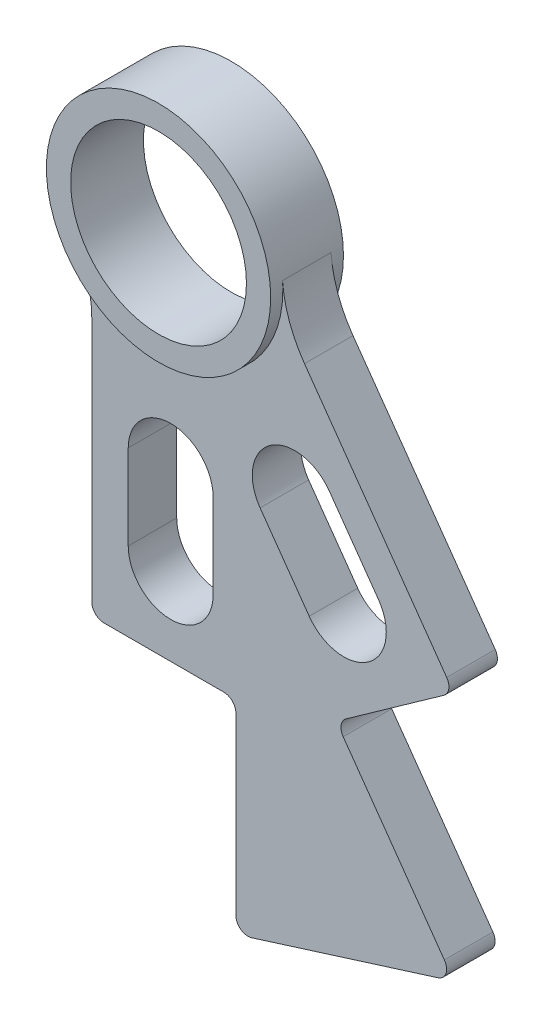
ISO-10303-21;
HEADER;
FILE_DESCRIPTION(('STEP AP214'),'2;1');
FILE_NAME('part.step','',(''),(''),'','','');
FILE_SCHEMA(('AUTOMOTIVE_DESIGN { 1 0 10303 214 1 1 1 1 }'));
ENDSEC;
DATA;
#1=APPLICATION_CONTEXT('core data for automotive mechanical design processes');
#2=APPLICATION_PROTOCOL_DEFINITION('international standard','automotive_design',2000,#1);
#3=PRODUCT_CONTEXT('',#1,'mechanical');
#4=PRODUCT('Part','Part','',(#3));
#5=PRODUCT_RELATED_PRODUCT_CATEGORY('part','',(#4));
#6=PRODUCT_DEFINITION_FORMATION('','',#4);
#7=PRODUCT_DEFINITION_CONTEXT('part definition',#1,'design');
#8=PRODUCT_DEFINITION('design','',#6,#7);
#9=PRODUCT_DEFINITION_SHAPE('','',#8);
#10=(LENGTH_UNIT() NAMED_UNIT(*) SI_UNIT(.MILLI.,.METRE.));
#11=(NAMED_UNIT(*) PLANE_ANGLE_UNIT() SI_UNIT($,.RADIAN.));
#12=(NAMED_UNIT(*) SI_UNIT($,.STERADIAN.) SOLID_ANGLE_UNIT());
#13=UNCERTAINTY_MEASURE_WITH_UNIT(LENGTH_MEASURE(1.E-05),#10,'distance_accuracy_value','');
#14=(GEOMETRIC_REPRESENTATION_CONTEXT(3) GLOBAL_UNCERTAINTY_ASSIGNED_CONTEXT((#13)) GLOBAL_UNIT_ASSIGNED_CONTEXT((#10,
#11,#12)) REPRESENTATION_CONTEXT('',''));
#15=CARTESIAN_POINT('',(0.,0.,0.));
#16=DIRECTION('',(0.,0.,1.));
#17=DIRECTION('',(1.,0.,0.));
#18=AXIS2_PLACEMENT_3D('',#15,#16,#17);
#19=CARTESIAN_POINT('',(0.,0.,4.7625));
#20=DIRECTION('',(0.,0.,-1.));
#21=DIRECTION('',(-1.,0.,0.));
#22=AXIS2_PLACEMENT_3D('',#19,#20,#21);
#23=CYLINDRICAL_SURFACE('',#22,11.5062);
#24=CARTESIAN_POINT('',(0.,0.,4.7625));
#25=DIRECTION('',(0.,0.,1.));
#26=DIRECTION('',(1.,0.,0.));
#27=AXIS2_PLACEMENT_3D('',#24,#25,#26);
#28=CIRCLE('',#27,11.5062);
#29=CARTESIAN_POINT('',(11.5062,0.,4.7625));
#30=VERTEX_POINT('',#29);
#31=EDGE_CURVE('E341',#30,#30,#28,.T.);
#32=ORIENTED_EDGE('',*,*,#31,.T.);
#33=EDGE_LOOP('',(#32));
#34=FACE_BOUND('',#33,.T.);
#35=CARTESIAN_POINT('',(0.,0.,-4.7625));
#36=DIRECTION('',(0.,0.,1.));
#37=DIRECTION('',(1.,0.,0.));
#38=AXIS2_PLACEMENT_3D('',#35,#36,#37);
#39=CIRCLE('',#38,11.5062);
#40=CARTESIAN_POINT('',(11.5062,0.,-4.7625));
#41=VERTEX_POINT('',#40);
#42=EDGE_CURVE('E329',#41,#41,#39,.T.);
#43=ORIENTED_EDGE('',*,*,#42,.F.);
#44=EDGE_LOOP('',(#43));
#45=FACE_BOUND('',#44,.T.);
#46=ADVANCED_FACE('F40',(#34,#45),#23,.F.);
#47=CARTESIAN_POINT('',(0.,0.,4.7625));
#48=DIRECTION('',(0.,0.,-1.));
#49=DIRECTION('',(-1.,0.,0.));
#50=AXIS2_PLACEMENT_3D('',#47,#48,#49);
#51=CYLINDRICAL_SURFACE('',#50,14.6812);
#52=DIRECTION('',(0.,0.,-1.));
#53=VECTOR('',#52,1.);
#54=CARTESIAN_POINT('',(-12.585193266832,-7.55979787272687,3.175));
#55=LINE('',#54,#53);
#56=CARTESIAN_POINT('',(-12.585193266832,-7.55979787272688,3.175));
#57=VERTEX_POINT('',#56);
#58=CARTESIAN_POINT('',(-12.585193266832,-7.55979787272687,-3.175));
#59=VERTEX_POINT('',#58);
#60=EDGE_CURVE('E337',#57,#59,#55,.T.);
#61=ORIENTED_EDGE('',*,*,#60,.F.);
#62=CARTESIAN_POINT('',(0.,0.,3.175));
#63=DIRECTION('',(0.,0.,1.));
#64=DIRECTION('',(1.,0.,0.));
#65=AXIS2_PLACEMENT_3D('',#62,#63,#64);
#66=CIRCLE('',#65,14.6812);
#67=CARTESIAN_POINT('',(14.6391568085927,1.11027986266355,3.175));
#68=VERTEX_POINT('',#67);
#69=EDGE_CURVE('E229',#57,#68,#66,.T.);
#70=ORIENTED_EDGE('',*,*,#69,.T.);
#71=DIRECTION('',(0.,0.,-1.));
#72=VECTOR('',#71,1.);
#73=CARTESIAN_POINT('',(14.6391568085926,1.11027986266355,3.175));
#74=LINE('',#73,#72);
#75=CARTESIAN_POINT('',(14.6391568085926,1.11027986266355,-3.175));
#76=VERTEX_POINT('',#75);
#77=EDGE_CURVE('E226',#68,#76,#74,.T.);
#78=ORIENTED_EDGE('',*,*,#77,.T.);
#79=CARTESIAN_POINT('',(0.,0.,-3.175));
#80=DIRECTION('',(0.,0.,1.));
#81=DIRECTION('',(1.,0.,0.));
#82=AXIS2_PLACEMENT_3D('',#79,#80,#81);
#83=CIRCLE('',#82,14.6812);
#84=EDGE_CURVE('E278',#59,#76,#83,.T.);
#85=ORIENTED_EDGE('',*,*,#84,.F.);
#86=EDGE_LOOP('',(#61,#70,#78,#85));
#87=FACE_BOUND('',#86,.T.);
#88=CARTESIAN_POINT('',(0.,0.,4.7625));
#89=DIRECTION('',(0.,0.,1.));
#90=DIRECTION('',(1.,0.,0.));
#91=AXIS2_PLACEMENT_3D('',#88,#89,#90);
#92=CIRCLE('',#91,14.6812);
#93=CARTESIAN_POINT('',(14.6812,0.,4.7625));
#94=VERTEX_POINT('',#93);
#95=EDGE_CURVE('E345',#94,#94,#92,.T.);
#96=ORIENTED_EDGE('',*,*,#95,.F.);
#97=EDGE_LOOP('',(#96));
#98=FACE_BOUND('',#97,.T.);
#99=CARTESIAN_POINT('',(0.,0.,-4.7625));
#100=DIRECTION('',(0.,0.,1.));
#101=DIRECTION('',(1.,0.,0.));
#102=AXIS2_PLACEMENT_3D('',#99,#100,#101);
#103=CIRCLE('',#102,14.6812);
#104=CARTESIAN_POINT('',(14.6812,0.,-4.7625));
#105=VERTEX_POINT('',#104);
#106=EDGE_CURVE('E346',#105,#105,#103,.T.);
#107=ORIENTED_EDGE('',*,*,#106,.T.);
#108=EDGE_LOOP('',(#107));
#109=FACE_BOUND('',#108,.T.);
#110=ADVANCED_FACE('F445',(#87,#98,#109),#51,.T.);
#111=CARTESIAN_POINT('',(0.,0.,4.7625));
#112=DIRECTION('',(0.,0.,1.));
#113=DIRECTION('',(1.,0.,0.));
#114=AXIS2_PLACEMENT_3D('',#111,#112,#113);
#115=PLANE('',#114);
#116=ORIENTED_EDGE('',*,*,#31,.F.);
#117=EDGE_LOOP('',(#116));
#118=FACE_BOUND('',#117,.T.);
#119=ORIENTED_EDGE('',*,*,#95,.T.);
#120=EDGE_LOOP('',(#119));
#121=FACE_BOUND('',#120,.T.);
#122=ADVANCED_FACE('F470',(#118,#121),#115,.T.);
#123=CARTESIAN_POINT('',(0.,0.,-4.7625));
#124=DIRECTION('',(0.,0.,1.));
#125=DIRECTION('',(1.,0.,0.));
#126=AXIS2_PLACEMENT_3D('',#123,#124,#125);
#127=PLANE('',#126);
#128=ORIENTED_EDGE('',*,*,#42,.T.);
#129=EDGE_LOOP('',(#128));
#130=FACE_BOUND('',#129,.T.);
#131=ORIENTED_EDGE('',*,*,#106,.F.);
#132=EDGE_LOOP('',(#131));
#133=FACE_BOUND('',#132,.T.);
#134=ADVANCED_FACE('F679',(#130,#133),#127,.F.);
#135=CARTESIAN_POINT('',(0.,-27.9580697939256,3.175));
#136=DIRECTION('',(0.,0.,-1.));
#137=DIRECTION('',(-1.,0.,0.));
#138=AXIS2_PLACEMENT_3D('',#135,#136,#137);
#139=CYLINDRICAL_SURFACE('',#138,5.55624999999839);
#140=CARTESIAN_POINT('',(0.,-27.9580697939256,-3.175));
#141=DIRECTION('',(0.,0.,1.));
#142=DIRECTION('',(1.,0.,0.));
#143=AXIS2_PLACEMENT_3D('',#140,#141,#142);
#144=CIRCLE('',#143,5.55624999999839);
#145=CARTESIAN_POINT('',(5.55624999999839,-27.9580697939257,-3.175));
#146=VERTEX_POINT('',#145);
#147=CARTESIAN_POINT('',(-5.55624999999839,-27.9580697939257,-3.175));
#148=VERTEX_POINT('',#147);
#149=EDGE_CURVE('E307',#146,#148,#144,.T.);
#150=ORIENTED_EDGE('',*,*,#149,.F.);
#151=DIRECTION('',(0.,0.,-1.));
#152=VECTOR('',#151,1.);
#153=CARTESIAN_POINT('',(5.55624999999839,-27.9580697939257,3.175));
#154=LINE('',#153,#152);
#155=CARTESIAN_POINT('',(5.55624999999839,-27.9580697939257,3.175));
#156=VERTEX_POINT('',#155);
#157=EDGE_CURVE('E327',#156,#146,#154,.T.);
#158=ORIENTED_EDGE('',*,*,#157,.F.);
#159=CARTESIAN_POINT('',(0.,-27.9580697939256,3.175));
#160=DIRECTION('',(0.,0.,1.));
#161=DIRECTION('',(1.,0.,0.));
#162=AXIS2_PLACEMENT_3D('',#159,#160,#161);
#163=CIRCLE('',#162,5.55624999999839);
#164=CARTESIAN_POINT('',(-5.55624999999839,-27.9580697939257,3.175));
#165=VERTEX_POINT('',#164);
#166=EDGE_CURVE('E257',#156,#165,#163,.T.);
#167=ORIENTED_EDGE('',*,*,#166,.T.);
#168=DIRECTION('',(0.,0.,-1.));
#169=VECTOR('',#168,1.);
#170=CARTESIAN_POINT('',(-5.55624999999839,-27.9580697939257,3.175));
#171=LINE('',#170,#169);
#172=EDGE_CURVE('E320',#165,#148,#171,.T.);
#173=ORIENTED_EDGE('',*,*,#172,.T.);
#174=EDGE_LOOP('',(#150,#158,#167,#173));
#175=FACE_BOUND('',#174,.T.);
#176=ADVANCED_FACE('F669',(#175),#139,.F.);
#177=CARTESIAN_POINT('',(5.5562499999984,0.,3.175));
#178=DIRECTION('',(-1.,0.,0.));
#179=DIRECTION('',(0.,-1.,0.));
#180=AXIS2_PLACEMENT_3D('',#177,#178,#179);
#181=PLANE('',#180);
#182=DIRECTION('',(0.,1.,0.));
#183=VECTOR('',#182,1.);
#184=CARTESIAN_POINT('',(5.5562499999984,0.,-3.175));
#185=LINE('',#184,#183);
#186=CARTESIAN_POINT('',(5.55624999999839,-39.0705697939289,-3.175));
#187=VERTEX_POINT('',#186);
#188=EDGE_CURVE('E310',#187,#146,#185,.T.);
#189=ORIENTED_EDGE('',*,*,#188,.F.);
#190=DIRECTION('',(0.,0.,-1.));
#191=VECTOR('',#190,1.);
#192=CARTESIAN_POINT('',(5.55624999999839,-39.0705697939289,3.175));
#193=LINE('',#192,#191);
#194=CARTESIAN_POINT('',(5.55624999999839,-39.0705697939289,3.175));
#195=VERTEX_POINT('',#194);
#196=EDGE_CURVE('E325',#195,#187,#193,.T.);
#197=ORIENTED_EDGE('',*,*,#196,.F.);
#198=DIRECTION('',(0.,1.,0.));
#199=VECTOR('',#198,1.);
#200=CARTESIAN_POINT('',(5.5562499999984,0.,3.175));
#201=LINE('',#200,#199);
#202=EDGE_CURVE('E260',#195,#156,#201,.T.);
#203=ORIENTED_EDGE('',*,*,#202,.T.);
#204=ORIENTED_EDGE('',*,*,#157,.T.);
#205=EDGE_LOOP('',(#189,#197,#203,#204));
#206=FACE_BOUND('',#205,.T.);
#207=ADVANCED_FACE('F659',(#206),#181,.T.);
#208=CARTESIAN_POINT('',(0.,-39.0705697939289,3.175));
#209=DIRECTION('',(0.,0.,-1.));
#210=DIRECTION('',(-1.,0.,0.));
#211=AXIS2_PLACEMENT_3D('',#208,#209,#210);
#212=CYLINDRICAL_SURFACE('',#211,5.55624999999839);
#213=CARTESIAN_POINT('',(0.,-39.0705697939289,-3.175));
#214=DIRECTION('',(0.,0.,1.));
#215=DIRECTION('',(1.,0.,0.));
#216=AXIS2_PLACEMENT_3D('',#213,#214,#215);
#217=CIRCLE('',#216,5.55624999999839);
#218=CARTESIAN_POINT('',(-5.55624999999839,-39.0705697939289,-3.175));
#219=VERTEX_POINT('',#218);
#220=EDGE_CURVE('E313',#219,#187,#217,.T.);
#221=ORIENTED_EDGE('',*,*,#220,.F.);
#222=DIRECTION('',(0.,0.,-1.));
#223=VECTOR('',#222,1.);
#224=CARTESIAN_POINT('',(-5.55624999999839,-39.0705697939289,3.175));
#225=LINE('',#224,#223);
#226=CARTESIAN_POINT('',(-5.55624999999839,-39.0705697939289,3.175));
#227=VERTEX_POINT('',#226);
#228=EDGE_CURVE('E322',#227,#219,#225,.T.);
#229=ORIENTED_EDGE('',*,*,#228,.F.);
#230=CARTESIAN_POINT('',(0.,-39.0705697939289,3.175));
#231=DIRECTION('',(0.,0.,1.));
#232=DIRECTION('',(1.,0.,0.));
#233=AXIS2_PLACEMENT_3D('',#230,#231,#232);
#234=CIRCLE('',#233,5.55624999999839);
#235=EDGE_CURVE('E263',#227,#195,#234,.T.);
#236=ORIENTED_EDGE('',*,*,#235,.T.);
#237=ORIENTED_EDGE('',*,*,#196,.T.);
#238=EDGE_LOOP('',(#221,#229,#236,#237));
#239=FACE_BOUND('',#238,.T.);
#240=ADVANCED_FACE('F649',(#239),#212,.F.);
#241=CARTESIAN_POINT('',(16.2411710413148,-22.9127804627989,3.175));
#242=DIRECTION('',(0.,0.,-1.));
#243=DIRECTION('',(-1.,0.,0.));
#244=AXIS2_PLACEMENT_3D('',#241,#242,#243);
#245=CYLINDRICAL_SURFACE('',#244,5.55624999999837);
#246=CARTESIAN_POINT('',(16.2411710413148,-22.9127804627989,-3.175));
#247=DIRECTION('',(0.,0.,1.));
#248=DIRECTION('',(1.,0.,0.));
#249=AXIS2_PLACEMENT_3D('',#246,#247,#248);
#250=CIRCLE('',#249,5.55624999999837);
#251=CARTESIAN_POINT('',(20.774153774864,-19.6996851327742,-3.175));
#252=VERTEX_POINT('',#251);
#253=CARTESIAN_POINT('',(11.7081883077655,-26.1258757928235,-3.175));
#254=VERTEX_POINT('',#253);
#255=EDGE_CURVE('E295',#252,#254,#250,.T.);
#256=ORIENTED_EDGE('',*,*,#255,.F.);
#257=DIRECTION('',(0.,0.,-1.));
#258=VECTOR('',#257,1.);
#259=CARTESIAN_POINT('',(20.774153774864,-19.6996851327742,3.175));
#260=LINE('',#259,#258);
#261=CARTESIAN_POINT('',(20.774153774864,-19.6996851327742,3.175));
#262=VERTEX_POINT('',#261);
#263=EDGE_CURVE('E323',#262,#252,#260,.T.);
#264=ORIENTED_EDGE('',*,*,#263,.F.);
#265=CARTESIAN_POINT('',(16.2411710413148,-22.9127804627989,3.175));
#266=DIRECTION('',(0.,0.,1.));
#267=DIRECTION('',(1.,0.,0.));
#268=AXIS2_PLACEMENT_3D('',#265,#266,#267);
#269=CIRCLE('',#268,5.55624999999837);
#270=CARTESIAN_POINT('',(11.7081883077655,-26.1258757928235,3.175));
#271=VERTEX_POINT('',#270);
#272=EDGE_CURVE('E246',#262,#271,#269,.T.);
#273=ORIENTED_EDGE('',*,*,#272,.T.);
#274=DIRECTION('',(0.,0.,-1.));
#275=VECTOR('',#274,1.);
#276=CARTESIAN_POINT('',(11.7081883077655,-26.1258757928235,3.175));
#277=LINE('',#276,#275);
#278=EDGE_CURVE('E225',#271,#254,#277,.T.);
#279=ORIENTED_EDGE('',*,*,#278,.T.);
#280=EDGE_LOOP('',(#256,#264,#273,#279));
#281=FACE_BOUND('',#280,.T.);
#282=ADVANCED_FACE('F639',(#281),#245,.F.);
#283=CARTESIAN_POINT('',(4.53298273354924,3.21309533002468,3.175));
#284=DIRECTION('',(-0.815834912675017,-0.578284873795387,0.));
#285=DIRECTION('',(0.578284873795387,-0.815834912675018,0.));
#286=AXIS2_PLACEMENT_3D('',#283,#284,#285);
#287=PLANE('',#286);
#288=DIRECTION('',(-0.578284873795387,0.815834912675018,0.));
#289=VECTOR('',#288,1.);
#290=CARTESIAN_POINT('',(4.53298273354924,3.21309533002468,-3.175));
#291=LINE('',#290,#289);
#292=CARTESIAN_POINT('',(27.2003444349171,-28.7656505998779,-3.175));
#293=VERTEX_POINT('',#292);
#294=EDGE_CURVE('E298',#293,#252,#291,.T.);
#295=ORIENTED_EDGE('',*,*,#294,.F.);
#296=DIRECTION('',(0.,0.,-1.));
#297=VECTOR('',#296,1.);
#298=CARTESIAN_POINT('',(27.2003444349171,-28.7656505998779,3.175));
#299=LINE('',#298,#297);
#300=CARTESIAN_POINT('',(27.2003444349171,-28.7656505998779,3.175));
#301=VERTEX_POINT('',#300);
#302=EDGE_CURVE('E333',#301,#293,#299,.T.);
#303=ORIENTED_EDGE('',*,*,#302,.F.);
#304=DIRECTION('',(-0.578284873795387,0.815834912675018,0.));
#305=VECTOR('',#304,1.);
#306=CARTESIAN_POINT('',(4.53298273354924,3.21309533002468,3.175));
#307=LINE('',#306,#305);
#308=EDGE_CURVE('E249',#301,#262,#307,.T.);
#309=ORIENTED_EDGE('',*,*,#308,.T.);
#310=ORIENTED_EDGE('',*,*,#263,.T.);
#311=EDGE_LOOP('',(#295,#303,#309,#310));
#312=FACE_BOUND('',#311,.T.);
#313=ADVANCED_FACE('F629',(#312),#287,.T.);
#314=CARTESIAN_POINT('',(22.6673617013679,-31.9787459299026,3.175));
#315=DIRECTION('',(0.,0.,-1.));
#316=DIRECTION('',(-1.,0.,0.));
#317=AXIS2_PLACEMENT_3D('',#314,#315,#316);
#318=CYLINDRICAL_SURFACE('',#317,5.55624999999837);
#319=CARTESIAN_POINT('',(22.6673617013679,-31.9787459299026,-3.175));
#320=DIRECTION('',(0.,0.,1.));
#321=DIRECTION('',(1.,0.,0.));
#322=AXIS2_PLACEMENT_3D('',#319,#320,#321);
#323=CIRCLE('',#322,5.55624999999837);
#324=CARTESIAN_POINT('',(18.1343789678186,-35.1918412599272,-3.175));
#325=VERTEX_POINT('',#324);
#326=EDGE_CURVE('E301',#325,#293,#323,.T.);
#327=ORIENTED_EDGE('',*,*,#326,.F.);
#328=DIRECTION('',(0.,0.,-1.));
#329=VECTOR('',#328,1.);
#330=CARTESIAN_POINT('',(18.1343789678186,-35.1918412599272,3.175));
#331=LINE('',#330,#329);
#332=CARTESIAN_POINT('',(18.1343789678186,-35.1918412599272,3.175));
#333=VERTEX_POINT('',#332);
#334=EDGE_CURVE('E331',#333,#325,#331,.T.);
#335=ORIENTED_EDGE('',*,*,#334,.F.);
#336=CARTESIAN_POINT('',(22.6673617013679,-31.9787459299026,3.175));
#337=DIRECTION('',(0.,0.,1.));
#338=DIRECTION('',(1.,0.,0.));
#339=AXIS2_PLACEMENT_3D('',#336,#337,#338);
#340=CIRCLE('',#339,5.55624999999837);
#341=EDGE_CURVE('E252',#333,#301,#340,.T.);
#342=ORIENTED_EDGE('',*,*,#341,.T.);
#343=ORIENTED_EDGE('',*,*,#302,.T.);
#344=EDGE_LOOP('',(#327,#335,#342,#343));
#345=FACE_BOUND('',#344,.T.);
#346=ADVANCED_FACE('F595',(#345),#318,.F.);
#347=CARTESIAN_POINT('',(-6.96784203042782,-4.938986535867,3.175));
#348=DIRECTION('',(-0.815834912675017,-0.578284873795387,0.));
#349=DIRECTION('',(0.578284873795387,-0.815834912675018,0.));
#350=AXIS2_PLACEMENT_3D('',#347,#348,#349);
#351=PLANE('',#350);
#352=DIRECTION('',(-0.578284873795387,0.815834912675018,0.));
#353=VECTOR('',#352,1.);
#354=CARTESIAN_POINT('',(-6.96784203042782,-4.938986535867,-3.175));
#355=LINE('',#354,#353);
#356=CARTESIAN_POINT('',(35.828390380426,-65.3152165115493,-3.175));
#357=VERTEX_POINT('',#356);
#358=CARTESIAN_POINT('',(22.5847239495654,-46.6312668948052,-3.175));
#359=VERTEX_POINT('',#358);
#360=EDGE_CURVE('E269',#357,#359,#355,.T.);
#361=ORIENTED_EDGE('',*,*,#360,.T.);
#362=DIRECTION('',(0.,0.,-1.));
#363=VECTOR('',#362,1.);
#364=CARTESIAN_POINT('',(22.5847239495654,-46.6312668948052,3.175));
#365=LINE('',#364,#363);
#366=CARTESIAN_POINT('',(22.5847239495654,-46.6312668948052,3.175));
#367=VERTEX_POINT('',#366);
#368=EDGE_CURVE('E362',#359,#367,#365,.F.);
#369=ORIENTED_EDGE('',*,*,#368,.T.);
#370=DIRECTION('',(-0.578284873795387,0.815834912675018,0.));
#371=VECTOR('',#370,1.);
#372=CARTESIAN_POINT('',(-6.96784203042782,-4.938986535867,3.175));
#373=LINE('',#372,#371);
#374=CARTESIAN_POINT('',(35.828390380426,-65.3152165115493,3.175));
#375=VERTEX_POINT('',#374);
#376=EDGE_CURVE('E319',#375,#367,#373,.T.);
#377=ORIENTED_EDGE('',*,*,#376,.F.);
#378=DIRECTION('',(0.,0.,-1.));
#379=VECTOR('',#378,1.);
#380=CARTESIAN_POINT('',(35.828390380426,-65.3152165115493,3.175));
#381=LINE('',#380,#379);
#382=EDGE_CURVE('E359',#375,#357,#381,.T.);
#383=ORIENTED_EDGE('',*,*,#382,.T.);
#384=EDGE_LOOP('',(#361,#369,#377,#383));
#385=FACE_BOUND('',#384,.T.);
#386=ADVANCED_FACE('F430',(#385),#351,.F.);
#387=CARTESIAN_POINT('',(28.634538742843,-40.3971424350667,3.175));
#388=DIRECTION('',(-0.578284873795385,0.815834912675019,0.));
#389=DIRECTION('',(-0.815834912675019,-0.578284873795385,0.));
#390=AXIS2_PLACEMENT_3D('',#387,#388,#389);
#391=PLANE('',#390);
#392=DIRECTION('',(0.815834912675019,0.578284873795385,0.));
#393=VECTOR('',#392,1.);
#394=CARTESIAN_POINT('',(28.634538742843,-40.3971424350667,3.175));
#395=LINE('',#394,#393);
#396=CARTESIAN_POINT('',(22.9618346362868,-44.4181017337834,3.175));
#397=VERTEX_POINT('',#396);
#398=CARTESIAN_POINT('',(35.7577973241355,-35.3479926307416,3.175));
#399=VERTEX_POINT('',#398);
#400=EDGE_CURVE('E215',#397,#399,#395,.T.);
#401=ORIENTED_EDGE('',*,*,#400,.F.);
#402=DIRECTION('',(0.,0.,-1.));
#403=VECTOR('',#402,1.);
#404=CARTESIAN_POINT('',(22.9618346362868,-44.4181017337834,-3.175));
#405=LINE('',#404,#403);
#406=CARTESIAN_POINT('',(22.9618346362868,-44.4181017337834,-3.175));
#407=VERTEX_POINT('',#406);
#408=EDGE_CURVE('E356',#397,#407,#405,.T.);
#409=ORIENTED_EDGE('',*,*,#408,.T.);
#410=DIRECTION('',(0.815834912675019,0.578284873795385,0.));
#411=VECTOR('',#410,1.);
#412=CARTESIAN_POINT('',(28.634538742843,-40.3971424350667,-3.175));
#413=LINE('',#412,#411);
#414=CARTESIAN_POINT('',(35.7577973241355,-35.3479926307416,-3.175));
#415=VERTEX_POINT('',#414);
#416=EDGE_CURVE('E272',#407,#415,#413,.T.);
#417=ORIENTED_EDGE('',*,*,#416,.T.);
#418=DIRECTION('',(0.,0.,-1.));
#419=VECTOR('',#418,1.);
#420=CARTESIAN_POINT('',(35.7577973241355,-35.3479926307416,3.175));
#421=LINE('',#420,#419);
#422=EDGE_CURVE('E349',#415,#399,#421,.F.);
#423=ORIENTED_EDGE('',*,*,#422,.T.);
#424=EDGE_LOOP('',(#401,#409,#417,#423));
#425=FACE_BOUND('',#424,.T.);
#426=ADVANCED_FACE('F576',(#425),#391,.F.);
#427=CARTESIAN_POINT('',(8.41839650516409,5.96717704147524,3.175));
#428=DIRECTION('',(-0.815834912675019,-0.578284873795385,0.));
#429=DIRECTION('',(0.578284873795385,-0.815834912675019,0.));
#430=AXIS2_PLACEMENT_3D('',#427,#428,#429);
#431=PLANE('',#430);
#432=DIRECTION('',(-0.578284873795385,0.815834912675019,0.));
#433=VECTOR('',#432,1.);
#434=CARTESIAN_POINT('',(8.41839650516409,5.96717704147524,3.175));
#435=LINE('',#434,#433);
#436=CARTESIAN_POINT('',(36.1349080108569,-33.1348274697199,3.175));
#437=VERTEX_POINT('',#436);
#438=CARTESIAN_POINT('',(17.5173156414512,-6.86943037360373,3.175));
#439=VERTEX_POINT('',#438);
#440=EDGE_CURVE('E200',#437,#439,#435,.T.);
#441=ORIENTED_EDGE('',*,*,#440,.F.);
#442=DIRECTION('',(0.,0.,-1.));
#443=VECTOR('',#442,1.);
#444=CARTESIAN_POINT('',(36.1349080108569,-33.1348274697199,3.175));
#445=LINE('',#444,#443);
#446=CARTESIAN_POINT('',(36.1349080108569,-33.1348274697199,-3.175));
#447=VERTEX_POINT('',#446);
#448=EDGE_CURVE('E384',#437,#447,#445,.T.);
#449=ORIENTED_EDGE('',*,*,#448,.T.);
#450=DIRECTION('',(-0.578284873795385,0.815834912675019,0.));
#451=VECTOR('',#450,1.);
#452=CARTESIAN_POINT('',(8.41839650516409,5.96717704147524,-3.175));
#453=LINE('',#452,#451);
#454=CARTESIAN_POINT('',(17.5173156414512,-6.86943037360373,-3.175));
#455=VERTEX_POINT('',#454);
#456=EDGE_CURVE('E221',#447,#455,#453,.T.);
#457=ORIENTED_EDGE('',*,*,#456,.T.);
#458=DIRECTION('',(0.,0.,-1.));
#459=VECTOR('',#458,1.);
#460=CARTESIAN_POINT('',(17.5173156414512,-6.86943037360373,3.175));
#461=LINE('',#460,#459);
#462=EDGE_CURVE('E218',#439,#455,#461,.T.);
#463=ORIENTED_EDGE('',*,*,#462,.F.);
#464=EDGE_LOOP('',(#441,#449,#457,#463));
#465=FACE_BOUND('',#464,.T.);
#466=ADVANCED_FACE('F219',(#465),#431,.F.);
#467=CARTESIAN_POINT('',(30.4686948801661,2.3108419978965,3.175));
#468=DIRECTION('',(0.,0.,-1.));
#469=DIRECTION('',(-1.,0.,0.));
#470=AXIS2_PLACEMENT_3D('',#467,#468,#469);
#471=CYLINDRICAL_SURFACE('',#470,15.8749999999984);
#472=CARTESIAN_POINT('',(30.4686948801661,2.3108419978965,-3.175));
#473=DIRECTION('',(0.,0.,1.));
#474=DIRECTION('',(1.,0.,0.));
#475=AXIS2_PLACEMENT_3D('',#472,#473,#474);
#476=CIRCLE('',#475,15.8749999999984);
#477=EDGE_CURVE('E276',#455,#76,#476,.F.);
#478=ORIENTED_EDGE('',*,*,#477,.T.);
#479=ORIENTED_EDGE('',*,*,#77,.F.);
#480=CARTESIAN_POINT('',(30.4686948801661,2.3108419978965,3.175));
#481=DIRECTION('',(0.,0.,1.));
#482=DIRECTION('',(1.,0.,0.));
#483=AXIS2_PLACEMENT_3D('',#480,#481,#482);
#484=CIRCLE('',#483,15.8749999999984);
#485=EDGE_CURVE('E207',#439,#68,#484,.F.);
#486=ORIENTED_EDGE('',*,*,#485,.F.);
#487=ORIENTED_EDGE('',*,*,#462,.T.);
#488=EDGE_LOOP('',(#478,#479,#486,#487));
#489=FACE_BOUND('',#488,.T.);
#490=ADVANCED_FACE('F228',(#489),#471,.F.);
#491=CARTESIAN_POINT('',(-26.1937499999968,-15.7343197939273,3.175));
#492=DIRECTION('',(0.,0.,-1.));
#493=DIRECTION('',(-1.,0.,0.));
#494=AXIS2_PLACEMENT_3D('',#491,#492,#493);
#495=CYLINDRICAL_SURFACE('',#494,15.8749999999984);
#496=CARTESIAN_POINT('',(-26.1937499999968,-15.7343197939273,-3.175));
#497=DIRECTION('',(0.,0.,1.));
#498=DIRECTION('',(1.,0.,0.));
#499=AXIS2_PLACEMENT_3D('',#496,#497,#498);
#500=CIRCLE('',#499,15.8749999999984);
#501=CARTESIAN_POINT('',(-10.3187499999984,-15.7343197939273,-3.175));
#502=VERTEX_POINT('',#501);
#503=EDGE_CURVE('E281',#502,#59,#500,.T.);
#504=ORIENTED_EDGE('',*,*,#503,.F.);
#505=DIRECTION('',(0.,0.,-1.));
#506=VECTOR('',#505,1.);
#507=CARTESIAN_POINT('',(-10.3187499999984,-15.7343197939273,3.175));
#508=LINE('',#507,#506);
#509=CARTESIAN_POINT('',(-10.3187499999984,-15.7343197939273,3.175));
#510=VERTEX_POINT('',#509);
#511=EDGE_CURVE('E268',#510,#502,#508,.T.);
#512=ORIENTED_EDGE('',*,*,#511,.F.);
#513=CARTESIAN_POINT('',(-26.1937499999968,-15.7343197939273,3.175));
#514=DIRECTION('',(0.,0.,1.));
#515=DIRECTION('',(1.,0.,0.));
#516=AXIS2_PLACEMENT_3D('',#513,#514,#515);
#517=CIRCLE('',#516,15.8749999999984);
#518=EDGE_CURVE('E231',#510,#57,#517,.T.);
#519=ORIENTED_EDGE('',*,*,#518,.T.);
#520=ORIENTED_EDGE('',*,*,#60,.T.);
#521=EDGE_LOOP('',(#504,#512,#519,#520));
#522=FACE_BOUND('',#521,.T.);
#523=ADVANCED_FACE('F448',(#522),#495,.F.);
#524=CARTESIAN_POINT('',(-10.3187499999984,0.,3.175));
#525=DIRECTION('',(1.,0.,0.));
#526=DIRECTION('',(0.,1.,0.));
#527=AXIS2_PLACEMENT_3D('',#524,#525,#526);
#528=PLANE('',#527);
#529=DIRECTION('',(0.,-1.,0.));
#530=VECTOR('',#529,1.);
#531=CARTESIAN_POINT('',(-10.3187499999984,0.,-3.175));
#532=LINE('',#531,#530);
#533=CARTESIAN_POINT('',(-10.3187499999984,-47.8018197939273,-3.175));
#534=VERTEX_POINT('',#533);
#535=EDGE_CURVE('E284',#502,#534,#532,.T.);
#536=ORIENTED_EDGE('',*,*,#535,.T.);
#537=DIRECTION('',(0.,0.,-1.));
#538=VECTOR('',#537,1.);
#539=CARTESIAN_POINT('',(-10.3187499999984,-47.8018197939273,3.175));
#540=LINE('',#539,#538);
#541=CARTESIAN_POINT('',(-10.3187499999984,-47.8018197939273,3.175));
#542=VERTEX_POINT('',#541);
#543=EDGE_CURVE('E395',#534,#542,#540,.F.);
#544=ORIENTED_EDGE('',*,*,#543,.T.);
#545=DIRECTION('',(0.,-1.,0.));
#546=VECTOR('',#545,1.);
#547=CARTESIAN_POINT('',(-10.3187499999984,0.,3.175));
#548=LINE('',#547,#546);
#549=EDGE_CURVE('E237',#510,#542,#548,.T.);
#550=ORIENTED_EDGE('',*,*,#549,.F.);
#551=ORIENTED_EDGE('',*,*,#511,.T.);
#552=EDGE_LOOP('',(#536,#544,#550,#551));
#553=FACE_BOUND('',#552,.T.);
#554=ADVANCED_FACE('F455',(#553),#528,.F.);
#555=CARTESIAN_POINT('',(0.,-49.3893197939273,3.175));
#556=DIRECTION('',(0.,1.,0.));
#557=DIRECTION('',(-1.,0.,0.));
#558=AXIS2_PLACEMENT_3D('',#555,#556,#557);
#559=PLANE('',#558);
#560=DIRECTION('',(1.,0.,0.));
#561=VECTOR('',#560,1.);
#562=CARTESIAN_POINT('',(0.,-49.3893197939273,-3.175));
#563=LINE('',#562,#561);
#564=CARTESIAN_POINT('',(-8.73124999999839,-49.3893197939273,-3.175));
#565=VERTEX_POINT('',#564);
#566=CARTESIAN_POINT('',(6.95324999999839,-49.3893197939273,-3.175));
#567=VERTEX_POINT('',#566);
#568=EDGE_CURVE('E287',#565,#567,#563,.T.);
#569=ORIENTED_EDGE('',*,*,#568,.T.);
#570=DIRECTION('',(0.,0.,-1.));
#571=VECTOR('',#570,1.);
#572=CARTESIAN_POINT('',(6.95324999999839,-49.3893197939273,3.175));
#573=LINE('',#572,#571);
#574=CARTESIAN_POINT('',(6.95324999999839,-49.3893197939273,3.175));
#575=VERTEX_POINT('',#574);
#576=EDGE_CURVE('E393',#567,#575,#573,.F.);
#577=ORIENTED_EDGE('',*,*,#576,.T.);
#578=DIRECTION('',(1.,0.,0.));
#579=VECTOR('',#578,1.);
#580=CARTESIAN_POINT('',(0.,-49.3893197939273,3.175));
#581=LINE('',#580,#579);
#582=CARTESIAN_POINT('',(-8.73124999999839,-49.3893197939273,3.175));
#583=VERTEX_POINT('',#582);
#584=EDGE_CURVE('E240',#583,#575,#581,.T.);
#585=ORIENTED_EDGE('',*,*,#584,.F.);
#586=DIRECTION('',(0.,0.,-1.));
#587=VECTOR('',#586,1.);
#588=CARTESIAN_POINT('',(-8.73124999999839,-49.3893197939273,3.175));
#589=LINE('',#588,#587);
#590=EDGE_CURVE('E390',#583,#565,#589,.T.);
#591=ORIENTED_EDGE('',*,*,#590,.T.);
#592=EDGE_LOOP('',(#569,#577,#585,#591));
#593=FACE_BOUND('',#592,.T.);
#594=ADVANCED_FACE('F410',(#593),#559,.F.);
#595=CARTESIAN_POINT('',(8.54074999999838,0.,3.175));
#596=DIRECTION('',(1.,0.,0.));
#597=DIRECTION('',(0.,1.,0.));
#598=AXIS2_PLACEMENT_3D('',#595,#596,#597);
#599=PLANE('',#598);
#600=DIRECTION('',(0.,-1.,0.));
#601=VECTOR('',#600,1.);
#602=CARTESIAN_POINT('',(8.54074999999838,0.,-3.175));
#603=LINE('',#602,#601);
#604=CARTESIAN_POINT('',(8.54074999999839,-50.9768197939273,-3.175));
#605=VERTEX_POINT('',#604);
#606=CARTESIAN_POINT('',(8.5407499999984,-73.8968839644596,-3.175));
#607=VERTEX_POINT('',#606);
#608=EDGE_CURVE('E290',#605,#607,#603,.T.);
#609=ORIENTED_EDGE('',*,*,#608,.T.);
#610=DIRECTION('',(0.,0.,-1.));
#611=VECTOR('',#610,1.);
#612=CARTESIAN_POINT('',(8.5407499999984,-73.8968839644596,3.175));
#613=LINE('',#612,#611);
#614=CARTESIAN_POINT('',(8.5407499999984,-73.8968839644596,3.175));
#615=VERTEX_POINT('',#614);
#616=EDGE_CURVE('E55',#607,#615,#613,.F.);
#617=ORIENTED_EDGE('',*,*,#616,.T.);
#618=DIRECTION('',(0.,-1.,0.));
#619=VECTOR('',#618,1.);
#620=CARTESIAN_POINT('',(8.54074999999838,0.,3.175));
#621=LINE('',#620,#619);
#622=CARTESIAN_POINT('',(8.54074999999839,-50.9768197939273,3.175));
#623=VERTEX_POINT('',#622);
#624=EDGE_CURVE('E242',#623,#615,#621,.T.);
#625=ORIENTED_EDGE('',*,*,#624,.F.);
#626=DIRECTION('',(0.,0.,-1.));
#627=VECTOR('',#626,1.);
#628=CARTESIAN_POINT('',(8.54074999999839,-50.9768197939273,-3.175));
#629=LINE('',#628,#627);
#630=EDGE_CURVE('E386',#623,#605,#629,.T.);
#631=ORIENTED_EDGE('',*,*,#630,.T.);
#632=EDGE_LOOP('',(#609,#617,#625,#631));
#633=FACE_BOUND('',#632,.T.);
#634=ADVANCED_FACE('F414',(#633),#599,.F.);
#635=CARTESIAN_POINT('',(-4.53298273354923,-3.21309533002468,3.175));
#636=DIRECTION('',(-0.815834912675017,-0.578284873795388,0.));
#637=DIRECTION('',(0.578284873795388,-0.815834912675017,0.));
#638=AXIS2_PLACEMENT_3D('',#635,#636,#637);
#639=PLANE('',#638);
#640=DIRECTION('',(-0.578284873795388,0.815834912675017,0.));
#641=VECTOR('',#640,1.);
#642=CARTESIAN_POINT('',(-4.53298273354923,-3.21309533002468,-3.175));
#643=LINE('',#642,#641);
#644=EDGE_CURVE('E304',#325,#254,#643,.T.);
#645=ORIENTED_EDGE('',*,*,#644,.T.);
#646=ORIENTED_EDGE('',*,*,#278,.F.);
#647=DIRECTION('',(-0.578284873795388,0.815834912675017,0.));
#648=VECTOR('',#647,1.);
#649=CARTESIAN_POINT('',(-4.53298273354923,-3.21309533002468,3.175));
#650=LINE('',#649,#648);
#651=EDGE_CURVE('E255',#333,#271,#650,.T.);
#652=ORIENTED_EDGE('',*,*,#651,.F.);
#653=ORIENTED_EDGE('',*,*,#334,.T.);
#654=EDGE_LOOP('',(#645,#646,#652,#653));
#655=FACE_BOUND('',#654,.T.);
#656=ADVANCED_FACE('F546',(#655),#639,.F.);
#657=CARTESIAN_POINT('',(22.5069129432965,-71.6736759824732,3.175));
#658=DIRECTION('',(-0.299595204551019,0.954066409329054,0.));
#659=DIRECTION('',(-0.954066409329054,-0.299595204551019,0.));
#660=AXIS2_PLACEMENT_3D('',#657,#658,#659);
#661=PLANE('',#660);
#662=DIRECTION('',(0.954066409329054,0.299595204551019,0.));
#663=VECTOR('',#662,1.);
#664=CARTESIAN_POINT('',(22.5069129432965,-71.6736759824732,-3.175));
#665=LINE('',#664,#663);
#666=CARTESIAN_POINT('',(10.6038573872231,-75.4114643892695,-3.175));
#667=VERTEX_POINT('',#666);
#668=CARTESIAN_POINT('',(35.0088598437791,-67.7478241735093,-3.175));
#669=VERTEX_POINT('',#668);
#670=EDGE_CURVE('E292',#667,#669,#665,.T.);
#671=ORIENTED_EDGE('',*,*,#670,.T.);
#672=DIRECTION('',(0.,0.,-1.));
#673=VECTOR('',#672,1.);
#674=CARTESIAN_POINT('',(35.0088598437791,-67.7478241735093,3.175));
#675=LINE('',#674,#673);
#676=CARTESIAN_POINT('',(35.0088598437791,-67.7478241735093,3.175));
#677=VERTEX_POINT('',#676);
#678=EDGE_CURVE('E375',#669,#677,#675,.F.);
#679=ORIENTED_EDGE('',*,*,#678,.T.);
#680=DIRECTION('',(0.954066409329054,0.299595204551019,0.));
#681=VECTOR('',#680,1.);
#682=CARTESIAN_POINT('',(22.5069129432965,-71.6736759824732,3.175));
#683=LINE('',#682,#681);
#684=CARTESIAN_POINT('',(10.6038573872231,-75.4114643892695,3.175));
#685=VERTEX_POINT('',#684);
#686=EDGE_CURVE('E244',#685,#677,#683,.T.);
#687=ORIENTED_EDGE('',*,*,#686,.F.);
#688=DIRECTION('',(0.,0.,-1.));
#689=VECTOR('',#688,1.);
#690=CARTESIAN_POINT('',(10.6038573872231,-75.4114643892695,3.175));
#691=LINE('',#690,#689);
#692=EDGE_CURVE('E372',#685,#667,#691,.T.);
#693=ORIENTED_EDGE('',*,*,#692,.T.);
#694=EDGE_LOOP('',(#671,#679,#687,#693));
#695=FACE_BOUND('',#694,.T.);
#696=ADVANCED_FACE('F422',(#695),#661,.F.);
#697=CARTESIAN_POINT('',(-5.55624999999839,0.,3.175));
#698=DIRECTION('',(-1.,0.,0.));
#699=DIRECTION('',(0.,-1.,0.));
#700=AXIS2_PLACEMENT_3D('',#697,#698,#699);
#701=PLANE('',#700);
#702=DIRECTION('',(0.,1.,0.));
#703=VECTOR('',#702,1.);
#704=CARTESIAN_POINT('',(-5.55624999999839,0.,-3.175));
#705=LINE('',#704,#703);
#706=EDGE_CURVE('E316',#219,#148,#705,.T.);
#707=ORIENTED_EDGE('',*,*,#706,.T.);
#708=ORIENTED_EDGE('',*,*,#172,.F.);
#709=DIRECTION('',(0.,1.,0.));
#710=VECTOR('',#709,1.);
#711=CARTESIAN_POINT('',(-5.55624999999839,0.,3.175));
#712=LINE('',#711,#710);
#713=EDGE_CURVE('E266',#227,#165,#712,.T.);
#714=ORIENTED_EDGE('',*,*,#713,.F.);
#715=ORIENTED_EDGE('',*,*,#228,.T.);
#716=EDGE_LOOP('',(#707,#708,#714,#715));
#717=FACE_BOUND('',#716,.T.);
#718=ADVANCED_FACE('F535',(#717),#701,.F.);
#719=CARTESIAN_POINT('',(0.,0.,3.175));
#720=DIRECTION('',(0.,0.,1.));
#721=DIRECTION('',(1.,0.,0.));
#722=AXIS2_PLACEMENT_3D('',#719,#720,#721);
#723=PLANE('',#722);
#724=ORIENTED_EDGE('',*,*,#686,.T.);
#725=CARTESIAN_POINT('',(34.5332524565544,-66.2332437486995,3.175));
#726=DIRECTION('',(0.,0.,1.));
#727=DIRECTION('',(1.,0.,0.));
#728=AXIS2_PLACEMENT_3D('',#725,#726,#727);
#729=CIRCLE('',#728,1.5875);
#730=EDGE_CURVE('E382',#677,#375,#729,.T.);
#731=ORIENTED_EDGE('',*,*,#730,.T.);
#732=ORIENTED_EDGE('',*,*,#376,.T.);
#733=CARTESIAN_POINT('',(23.879861873437,-45.713239657655,3.175));
#734=DIRECTION('',(0.,0.,1.));
#735=DIRECTION('',(1.,0.,0.));
#736=AXIS2_PLACEMENT_3D('',#733,#734,#735);
#737=CIRCLE('',#736,1.5875);
#738=EDGE_CURVE('E399',#367,#397,#737,.F.);
#739=ORIENTED_EDGE('',*,*,#738,.T.);
#740=ORIENTED_EDGE('',*,*,#400,.T.);
#741=CARTESIAN_POINT('',(34.8397700869853,-34.05285470687,3.175));
#742=DIRECTION('',(0.,0.,1.));
#743=DIRECTION('',(1.,0.,0.));
#744=AXIS2_PLACEMENT_3D('',#741,#742,#743);
#745=CIRCLE('',#744,1.5875);
#746=EDGE_CURVE('E211',#399,#437,#745,.T.);
#747=ORIENTED_EDGE('',*,*,#746,.T.);
#748=ORIENTED_EDGE('',*,*,#440,.T.);
#749=ORIENTED_EDGE('',*,*,#485,.T.);
#750=ORIENTED_EDGE('',*,*,#69,.F.);
#751=ORIENTED_EDGE('',*,*,#518,.F.);
#752=ORIENTED_EDGE('',*,*,#549,.T.);
#753=CARTESIAN_POINT('',(-8.73124999999839,-47.8018197939273,3.175));
#754=DIRECTION('',(0.,0.,1.));
#755=DIRECTION('',(1.,0.,0.));
#756=AXIS2_PLACEMENT_3D('',#753,#754,#755);
#757=CIRCLE('',#756,1.5875);
#758=EDGE_CURVE('E377',#542,#583,#757,.T.);
#759=ORIENTED_EDGE('',*,*,#758,.T.);
#760=ORIENTED_EDGE('',*,*,#584,.T.);
#761=CARTESIAN_POINT('',(6.95324999999839,-50.9768197939273,3.175));
#762=DIRECTION('',(0.,0.,1.));
#763=DIRECTION('',(1.,0.,0.));
#764=AXIS2_PLACEMENT_3D('',#761,#762,#763);
#765=CIRCLE('',#764,1.5875);
#766=EDGE_CURVE('E11',#575,#623,#765,.F.);
#767=ORIENTED_EDGE('',*,*,#766,.T.);
#768=ORIENTED_EDGE('',*,*,#624,.T.);
#769=CARTESIAN_POINT('',(10.1282499999984,-73.8968839644596,3.175));
#770=DIRECTION('',(0.,0.,1.));
#771=DIRECTION('',(1.,0.,0.));
#772=AXIS2_PLACEMENT_3D('',#769,#770,#771);
#773=CIRCLE('',#772,1.5875);
#774=EDGE_CURVE('E379',#615,#685,#773,.T.);
#775=ORIENTED_EDGE('',*,*,#774,.T.);
#776=EDGE_LOOP('',(#724,#731,#732,#739,#740,#747,#748,#749,#750,#751,#752,#759,#760,#767,#768,#775));
#777=FACE_BOUND('',#776,.T.);
#778=ORIENTED_EDGE('',*,*,#272,.F.);
#779=ORIENTED_EDGE('',*,*,#308,.F.);
#780=ORIENTED_EDGE('',*,*,#341,.F.);
#781=ORIENTED_EDGE('',*,*,#651,.T.);
#782=EDGE_LOOP('',(#778,#779,#780,#781));
#783=FACE_BOUND('',#782,.T.);
#784=ORIENTED_EDGE('',*,*,#166,.F.);
#785=ORIENTED_EDGE('',*,*,#202,.F.);
#786=ORIENTED_EDGE('',*,*,#235,.F.);
#787=ORIENTED_EDGE('',*,*,#713,.T.);
#788=EDGE_LOOP('',(#784,#785,#786,#787));
#789=FACE_BOUND('',#788,.T.);
#790=ADVANCED_FACE('F203',(#777,#783,#789),#723,.T.);
#791=CARTESIAN_POINT('',(0.,0.,-3.175));
#792=DIRECTION('',(0.,0.,1.));
#793=DIRECTION('',(1.,0.,0.));
#794=AXIS2_PLACEMENT_3D('',#791,#792,#793);
#795=PLANE('',#794);
#796=ORIENTED_EDGE('',*,*,#360,.F.);
#797=CARTESIAN_POINT('',(34.5332524565544,-66.2332437486995,-3.175));
#798=DIRECTION('',(0.,0.,1.));
#799=DIRECTION('',(1.,0.,0.));
#800=AXIS2_PLACEMENT_3D('',#797,#798,#799);
#801=CIRCLE('',#800,1.5875);
#802=EDGE_CURVE('E370',#357,#669,#801,.F.);
#803=ORIENTED_EDGE('',*,*,#802,.T.);
#804=ORIENTED_EDGE('',*,*,#670,.F.);
#805=CARTESIAN_POINT('',(10.1282499999984,-73.8968839644596,-3.175));
#806=DIRECTION('',(0.,0.,1.));
#807=DIRECTION('',(1.,0.,0.));
#808=AXIS2_PLACEMENT_3D('',#805,#806,#807);
#809=CIRCLE('',#808,1.5875);
#810=EDGE_CURVE('E366',#667,#607,#809,.F.);
#811=ORIENTED_EDGE('',*,*,#810,.T.);
#812=ORIENTED_EDGE('',*,*,#608,.F.);
#813=CARTESIAN_POINT('',(6.95324999999839,-50.9768197939273,-3.175));
#814=DIRECTION('',(0.,0.,1.));
#815=DIRECTION('',(1.,0.,0.));
#816=AXIS2_PLACEMENT_3D('',#813,#814,#815);
#817=CIRCLE('',#816,1.5875);
#818=EDGE_CURVE('E48',#605,#567,#817,.T.);
#819=ORIENTED_EDGE('',*,*,#818,.T.);
#820=ORIENTED_EDGE('',*,*,#568,.F.);
#821=CARTESIAN_POINT('',(-8.73124999999839,-47.8018197939273,-3.175));
#822=DIRECTION('',(0.,0.,1.));
#823=DIRECTION('',(1.,0.,0.));
#824=AXIS2_PLACEMENT_3D('',#821,#822,#823);
#825=CIRCLE('',#824,1.5875);
#826=EDGE_CURVE('E364',#565,#534,#825,.F.);
#827=ORIENTED_EDGE('',*,*,#826,.T.);
#828=ORIENTED_EDGE('',*,*,#535,.F.);
#829=ORIENTED_EDGE('',*,*,#503,.T.);
#830=ORIENTED_EDGE('',*,*,#84,.T.);
#831=ORIENTED_EDGE('',*,*,#477,.F.);
#832=ORIENTED_EDGE('',*,*,#456,.F.);
#833=CARTESIAN_POINT('',(34.8397700869853,-34.05285470687,-3.175));
#834=DIRECTION('',(0.,0.,1.));
#835=DIRECTION('',(1.,0.,0.));
#836=AXIS2_PLACEMENT_3D('',#833,#834,#835);
#837=CIRCLE('',#836,1.5875);
#838=EDGE_CURVE('E368',#447,#415,#837,.F.);
#839=ORIENTED_EDGE('',*,*,#838,.T.);
#840=ORIENTED_EDGE('',*,*,#416,.F.);
#841=CARTESIAN_POINT('',(23.879861873437,-45.713239657655,-3.175));
#842=DIRECTION('',(0.,0.,1.));
#843=DIRECTION('',(1.,0.,0.));
#844=AXIS2_PLACEMENT_3D('',#841,#842,#843);
#845=CIRCLE('',#844,1.5875);
#846=EDGE_CURVE('E397',#407,#359,#845,.T.);
#847=ORIENTED_EDGE('',*,*,#846,.T.);
#848=EDGE_LOOP('',(#796,#803,#804,#811,#812,#819,#820,#827,#828,#829,#830,#831,#832,#839,#840,#847));
#849=FACE_BOUND('',#848,.T.);
#850=ORIENTED_EDGE('',*,*,#255,.T.);
#851=ORIENTED_EDGE('',*,*,#644,.F.);
#852=ORIENTED_EDGE('',*,*,#326,.T.);
#853=ORIENTED_EDGE('',*,*,#294,.T.);
#854=EDGE_LOOP('',(#850,#851,#852,#853));
#855=FACE_BOUND('',#854,.T.);
#856=ORIENTED_EDGE('',*,*,#149,.T.);
#857=ORIENTED_EDGE('',*,*,#706,.F.);
#858=ORIENTED_EDGE('',*,*,#220,.T.);
#859=ORIENTED_EDGE('',*,*,#188,.T.);
#860=EDGE_LOOP('',(#856,#857,#858,#859));
#861=FACE_BOUND('',#860,.T.);
#862=ADVANCED_FACE('F404',(#849,#855,#861),#795,.F.);
#863=CARTESIAN_POINT('',(23.879861873437,-45.713239657655,3.175));
#864=DIRECTION('',(0.,0.,1.));
#865=DIRECTION('',(1.,0.,0.));
#866=AXIS2_PLACEMENT_3D('',#863,#864,#865);
#867=CYLINDRICAL_SURFACE('',#866,1.5875);
#868=ORIENTED_EDGE('',*,*,#738,.F.);
#869=ORIENTED_EDGE('',*,*,#368,.F.);
#870=ORIENTED_EDGE('',*,*,#846,.F.);
#871=ORIENTED_EDGE('',*,*,#408,.F.);
#872=EDGE_LOOP('',(#868,#869,#870,#871));
#873=FACE_BOUND('',#872,.T.);
#874=ADVANCED_FACE('F475',(#873),#867,.F.);
#875=CARTESIAN_POINT('',(34.5332524565544,-66.2332437486995,3.175));
#876=DIRECTION('',(0.,0.,-1.));
#877=DIRECTION('',(-1.,0.,0.));
#878=AXIS2_PLACEMENT_3D('',#875,#876,#877);
#879=CYLINDRICAL_SURFACE('',#878,1.5875);
#880=ORIENTED_EDGE('',*,*,#730,.F.);
#881=ORIENTED_EDGE('',*,*,#678,.F.);
#882=ORIENTED_EDGE('',*,*,#802,.F.);
#883=ORIENTED_EDGE('',*,*,#382,.F.);
#884=EDGE_LOOP('',(#880,#881,#882,#883));
#885=FACE_BOUND('',#884,.T.);
#886=ADVANCED_FACE('F427',(#885),#879,.T.);
#887=CARTESIAN_POINT('',(34.8397700869853,-34.05285470687,3.175));
#888=DIRECTION('',(0.,0.,-1.));
#889=DIRECTION('',(-1.,0.,0.));
#890=AXIS2_PLACEMENT_3D('',#887,#888,#889);
#891=CYLINDRICAL_SURFACE('',#890,1.5875);
#892=ORIENTED_EDGE('',*,*,#746,.F.);
#893=ORIENTED_EDGE('',*,*,#422,.F.);
#894=ORIENTED_EDGE('',*,*,#838,.F.);
#895=ORIENTED_EDGE('',*,*,#448,.F.);
#896=EDGE_LOOP('',(#892,#893,#894,#895));
#897=FACE_BOUND('',#896,.T.);
#898=ADVANCED_FACE('F440',(#897),#891,.T.);
#899=CARTESIAN_POINT('',(10.1282499999984,-73.8968839644596,3.175));
#900=DIRECTION('',(0.,0.,-1.));
#901=DIRECTION('',(-1.,0.,0.));
#902=AXIS2_PLACEMENT_3D('',#899,#900,#901);
#903=CYLINDRICAL_SURFACE('',#902,1.5875);
#904=ORIENTED_EDGE('',*,*,#774,.F.);
#905=ORIENTED_EDGE('',*,*,#616,.F.);
#906=ORIENTED_EDGE('',*,*,#810,.F.);
#907=ORIENTED_EDGE('',*,*,#692,.F.);
#908=EDGE_LOOP('',(#904,#905,#906,#907));
#909=FACE_BOUND('',#908,.T.);
#910=ADVANCED_FACE('F419',(#909),#903,.T.);
#911=CARTESIAN_POINT('',(6.95324999999839,-50.9768197939273,3.175));
#912=DIRECTION('',(0.,0.,1.));
#913=DIRECTION('',(1.,0.,0.));
#914=AXIS2_PLACEMENT_3D('',#911,#912,#913);
#915=CYLINDRICAL_SURFACE('',#914,1.5875);
#916=ORIENTED_EDGE('',*,*,#766,.F.);
#917=ORIENTED_EDGE('',*,*,#576,.F.);
#918=ORIENTED_EDGE('',*,*,#818,.F.);
#919=ORIENTED_EDGE('',*,*,#630,.F.);
#920=EDGE_LOOP('',(#916,#917,#918,#919));
#921=FACE_BOUND('',#920,.T.);
#922=ADVANCED_FACE('F413',(#921),#915,.F.);
#923=CARTESIAN_POINT('',(-8.73124999999839,-47.8018197939273,3.175));
#924=DIRECTION('',(0.,0.,-1.));
#925=DIRECTION('',(-1.,0.,0.));
#926=AXIS2_PLACEMENT_3D('',#923,#924,#925);
#927=CYLINDRICAL_SURFACE('',#926,1.5875);
#928=ORIENTED_EDGE('',*,*,#758,.F.);
#929=ORIENTED_EDGE('',*,*,#543,.F.);
#930=ORIENTED_EDGE('',*,*,#826,.F.);
#931=ORIENTED_EDGE('',*,*,#590,.F.);
#932=EDGE_LOOP('',(#928,#929,#930,#931));
#933=FACE_BOUND('',#932,.T.);
#934=ADVANCED_FACE('F42',(#933),#927,.T.);
#935=CLOSED_SHELL('',(#46,#110,#122,#134,#176,#207,#240,#282,#313,#346,#386,#426,#466,#490,#523,
#554,#594,#634,#656,#696,#718,#790,#862,#874,#886,#898,#910,#922,#934));
#936=MANIFOLD_SOLID_BREP('B2',#935);
#937=ADVANCED_BREP_SHAPE_REPRESENTATION('',(#18,#936),#14);
#938=SHAPE_DEFINITION_REPRESENTATION(#9,#937);
ENDSEC;
END-ISO-10303-21;
